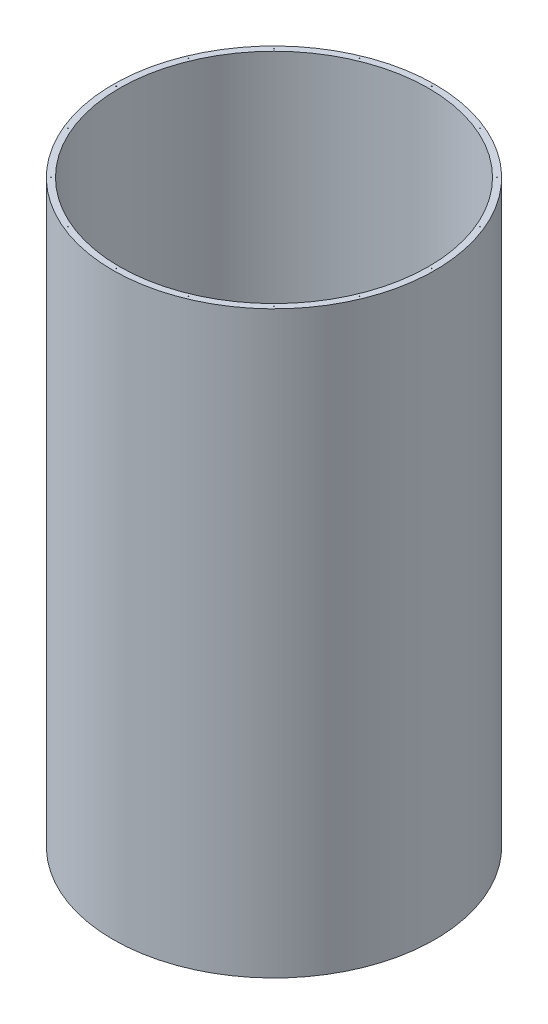
ISO-10303-21;
HEADER;
FILE_DESCRIPTION(('STEP AP214'),'2;1');
FILE_NAME('part.step','',(''),(''),'','','');
FILE_SCHEMA(('AUTOMOTIVE_DESIGN { 1 0 10303 214 1 1 1 1 }'));
ENDSEC;
DATA;
#1=APPLICATION_CONTEXT('core data for automotive mechanical design processes');
#2=APPLICATION_PROTOCOL_DEFINITION('international standard','automotive_design',2000,#1);
#3=PRODUCT_CONTEXT('',#1,'mechanical');
#4=PRODUCT('Part','Part','',(#3));
#5=PRODUCT_RELATED_PRODUCT_CATEGORY('part','',(#4));
#6=PRODUCT_DEFINITION_FORMATION('','',#4);
#7=PRODUCT_DEFINITION_CONTEXT('part definition',#1,'design');
#8=PRODUCT_DEFINITION('design','',#6,#7);
#9=PRODUCT_DEFINITION_SHAPE('','',#8);
#10=(LENGTH_UNIT() NAMED_UNIT(*) SI_UNIT(.MILLI.,.METRE.));
#11=(NAMED_UNIT(*) PLANE_ANGLE_UNIT() SI_UNIT($,.RADIAN.));
#12=(NAMED_UNIT(*) SI_UNIT($,.STERADIAN.) SOLID_ANGLE_UNIT());
#13=UNCERTAINTY_MEASURE_WITH_UNIT(LENGTH_MEASURE(1.E-05),#10,'distance_accuracy_value','');
#14=(GEOMETRIC_REPRESENTATION_CONTEXT(3) GLOBAL_UNCERTAINTY_ASSIGNED_CONTEXT((#13)) GLOBAL_UNIT_ASSIGNED_CONTEXT((#10,
#11,#12)) REPRESENTATION_CONTEXT('',''));
#15=CARTESIAN_POINT('',(0.,0.,0.));
#16=DIRECTION('',(0.,0.,1.));
#17=DIRECTION('',(1.,0.,0.));
#18=AXIS2_PLACEMENT_3D('',#15,#16,#17);
#19=CARTESIAN_POINT('',(0.,4500.,0.));
#20=DIRECTION('',(0.,1.,0.));
#21=DIRECTION('',(0.,0.,1.));
#22=AXIS2_PLACEMENT_3D('',#19,#20,#21);
#23=PLANE('',#22);
#24=CARTESIAN_POINT('',(-1225.,4500.,0.));
#25=DIRECTION('',(0.,1.,0.));
#26=DIRECTION('',(0.,0.,1.));
#27=AXIS2_PLACEMENT_3D('',#24,#25,#26);
#28=CIRCLE('',#27,3.17499999999986);
#29=CARTESIAN_POINT('',(-1225.,4500.,3.17499999999986));
#30=VERTEX_POINT('',#29);
#31=EDGE_CURVE('E144',#30,#30,#28,.T.);
#32=ORIENTED_EDGE('',*,*,#31,.F.);
#33=EDGE_LOOP('',(#32));
#34=FACE_BOUND('',#33,.T.);
#35=CARTESIAN_POINT('',(-1131.75242732633,4500.,-468.787204647236));
#36=DIRECTION('',(0.,1.,0.));
#37=DIRECTION('',(0.,0.,1.));
#38=AXIS2_PLACEMENT_3D('',#35,#36,#37);
#39=CIRCLE('',#38,3.17499999999989);
#40=CARTESIAN_POINT('',(-1131.75242732633,4500.,-465.612204647236));
#41=VERTEX_POINT('',#40);
#42=EDGE_CURVE('E141',#41,#41,#39,.T.);
#43=ORIENTED_EDGE('',*,*,#42,.F.);
#44=EDGE_LOOP('',(#43));
#45=FACE_BOUND('',#44,.T.);
#46=CARTESIAN_POINT('',(-866.205806953519,4500.,-866.205806953522));
#47=DIRECTION('',(0.,1.,0.));
#48=DIRECTION('',(0.,0.,1.));
#49=AXIS2_PLACEMENT_3D('',#46,#47,#48);
#50=CIRCLE('',#49,3.17499999999983);
#51=CARTESIAN_POINT('',(-866.205806953519,4500.,-863.030806953523));
#52=VERTEX_POINT('',#51);
#53=EDGE_CURVE('E135',#52,#52,#50,.T.);
#54=ORIENTED_EDGE('',*,*,#53,.F.);
#55=EDGE_LOOP('',(#54));
#56=FACE_BOUND('',#55,.T.);
#57=CARTESIAN_POINT('',(-468.787204647232,4500.,-1131.75242732633));
#58=DIRECTION('',(0.,1.,0.));
#59=DIRECTION('',(0.,0.,1.));
#60=AXIS2_PLACEMENT_3D('',#57,#58,#59);
#61=CIRCLE('',#60,3.17499999999994);
#62=CARTESIAN_POINT('',(-468.787204647232,4500.,-1128.57742732633));
#63=VERTEX_POINT('',#62);
#64=EDGE_CURVE('E129',#63,#63,#61,.T.);
#65=ORIENTED_EDGE('',*,*,#64,.F.);
#66=EDGE_LOOP('',(#65));
#67=FACE_BOUND('',#66,.T.);
#68=CARTESIAN_POINT('',(4.27706464008284E-12,4500.,-1225.));
#69=DIRECTION('',(0.,1.,0.));
#70=DIRECTION('',(0.,0.,1.));
#71=AXIS2_PLACEMENT_3D('',#68,#69,#70);
#72=CIRCLE('',#71,3.17499999999986);
#73=CARTESIAN_POINT('',(4.27706464008284E-12,4500.,-1221.825));
#74=VERTEX_POINT('',#73);
#75=EDGE_CURVE('E123',#74,#74,#72,.T.);
#76=ORIENTED_EDGE('',*,*,#75,.F.);
#77=EDGE_LOOP('',(#76));
#78=FACE_BOUND('',#77,.T.);
#79=CARTESIAN_POINT('',(468.78720464724,4500.,-1131.75242732632));
#80=DIRECTION('',(0.,1.,0.));
#81=DIRECTION('',(0.,0.,1.));
#82=AXIS2_PLACEMENT_3D('',#79,#80,#81);
#83=CIRCLE('',#82,3.17499999999989);
#84=CARTESIAN_POINT('',(468.78720464724,4500.,-1128.57742732632));
#85=VERTEX_POINT('',#84);
#86=EDGE_CURVE('E117',#85,#85,#83,.T.);
#87=ORIENTED_EDGE('',*,*,#86,.F.);
#88=EDGE_LOOP('',(#87));
#89=FACE_BOUND('',#88,.T.);
#90=CARTESIAN_POINT('',(866.205806953525,4500.,-866.205806953517));
#91=DIRECTION('',(0.,1.,0.));
#92=DIRECTION('',(0.,0.,1.));
#93=AXIS2_PLACEMENT_3D('',#90,#91,#92);
#94=CIRCLE('',#93,3.17499999999983);
#95=CARTESIAN_POINT('',(866.205806953525,4500.,-863.030806953517));
#96=VERTEX_POINT('',#95);
#97=EDGE_CURVE('E111',#96,#96,#94,.T.);
#98=ORIENTED_EDGE('',*,*,#97,.F.);
#99=EDGE_LOOP('',(#98));
#100=FACE_BOUND('',#99,.T.);
#101=CARTESIAN_POINT('',(1131.75242732633,4500.,-468.787204647228));
#102=DIRECTION('',(0.,1.,0.));
#103=DIRECTION('',(0.,0.,1.));
#104=AXIS2_PLACEMENT_3D('',#101,#102,#103);
#105=CIRCLE('',#104,3.1749999999999);
#106=CARTESIAN_POINT('',(1131.75242732633,4500.,-465.612204647228));
#107=VERTEX_POINT('',#106);
#108=EDGE_CURVE('E105',#107,#107,#105,.T.);
#109=ORIENTED_EDGE('',*,*,#108,.F.);
#110=EDGE_LOOP('',(#109));
#111=FACE_BOUND('',#110,.T.);
#112=CARTESIAN_POINT('',(1225.,4500.,8.55412928016568E-12));
#113=DIRECTION('',(0.,1.,0.));
#114=DIRECTION('',(0.,0.,1.));
#115=AXIS2_PLACEMENT_3D('',#112,#113,#114);
#116=CIRCLE('',#115,3.17499999999985);
#117=CARTESIAN_POINT('',(1225.,4500.,3.17500000000841));
#118=VERTEX_POINT('',#117);
#119=EDGE_CURVE('E99',#118,#118,#116,.T.);
#120=ORIENTED_EDGE('',*,*,#119,.F.);
#121=EDGE_LOOP('',(#120));
#122=FACE_BOUND('',#121,.T.);
#123=CARTESIAN_POINT('',(1131.75242732632,4500.,468.787204647244));
#124=DIRECTION('',(0.,1.,0.));
#125=DIRECTION('',(0.,0.,1.));
#126=AXIS2_PLACEMENT_3D('',#123,#124,#125);
#127=CIRCLE('',#126,3.17499999999989);
#128=CARTESIAN_POINT('',(1131.75242732632,4500.,471.962204647244));
#129=VERTEX_POINT('',#128);
#130=EDGE_CURVE('E93',#129,#129,#127,.T.);
#131=ORIENTED_EDGE('',*,*,#130,.F.);
#132=EDGE_LOOP('',(#131));
#133=FACE_BOUND('',#132,.T.);
#134=CARTESIAN_POINT('',(866.205806953513,4500.,866.205806953528));
#135=DIRECTION('',(0.,1.,0.));
#136=DIRECTION('',(0.,0.,1.));
#137=AXIS2_PLACEMENT_3D('',#134,#135,#136);
#138=CIRCLE('',#137,3.17499999999983);
#139=CARTESIAN_POINT('',(866.205806953513,4500.,869.380806953528));
#140=VERTEX_POINT('',#139);
#141=EDGE_CURVE('E87',#140,#140,#138,.T.);
#142=ORIENTED_EDGE('',*,*,#141,.F.);
#143=EDGE_LOOP('',(#142));
#144=FACE_BOUND('',#143,.T.);
#145=CARTESIAN_POINT('',(468.787204647224,4500.,1131.75242732633));
#146=DIRECTION('',(0.,1.,0.));
#147=DIRECTION('',(0.,0.,1.));
#148=AXIS2_PLACEMENT_3D('',#145,#146,#147);
#149=CIRCLE('',#148,3.17499999999994);
#150=CARTESIAN_POINT('',(468.787204647224,4500.,1134.92742732633));
#151=VERTEX_POINT('',#150);
#152=EDGE_CURVE('E81',#151,#151,#149,.T.);
#153=ORIENTED_EDGE('',*,*,#152,.F.);
#154=EDGE_LOOP('',(#153));
#155=FACE_BOUND('',#154,.T.);
#156=CARTESIAN_POINT('',(-1.28311939202485E-11,4500.,1225.));
#157=DIRECTION('',(0.,1.,0.));
#158=DIRECTION('',(0.,0.,1.));
#159=AXIS2_PLACEMENT_3D('',#156,#157,#158);
#160=CIRCLE('',#159,3.17499999999985);
#161=CARTESIAN_POINT('',(-1.28311939202485E-11,4500.,1228.175));
#162=VERTEX_POINT('',#161);
#163=EDGE_CURVE('E75',#162,#162,#160,.T.);
#164=ORIENTED_EDGE('',*,*,#163,.F.);
#165=EDGE_LOOP('',(#164));
#166=FACE_BOUND('',#165,.T.);
#167=CARTESIAN_POINT('',(-468.787204647247,4500.,1131.75242732632));
#168=DIRECTION('',(0.,1.,0.));
#169=DIRECTION('',(0.,0.,1.));
#170=AXIS2_PLACEMENT_3D('',#167,#168,#169);
#171=CIRCLE('',#170,3.17499999999989);
#172=CARTESIAN_POINT('',(-468.787204647247,4500.,1134.92742732632));
#173=VERTEX_POINT('',#172);
#174=EDGE_CURVE('E69',#173,#173,#171,.T.);
#175=ORIENTED_EDGE('',*,*,#174,.F.);
#176=EDGE_LOOP('',(#175));
#177=FACE_BOUND('',#176,.T.);
#178=CARTESIAN_POINT('',(-866.205806953531,4500.,866.20580695351));
#179=DIRECTION('',(0.,1.,0.));
#180=DIRECTION('',(0.,0.,1.));
#181=AXIS2_PLACEMENT_3D('',#178,#179,#180);
#182=CIRCLE('',#181,3.17499999999988);
#183=CARTESIAN_POINT('',(-866.205806953531,4500.,869.38080695351));
#184=VERTEX_POINT('',#183);
#185=EDGE_CURVE('E63',#184,#184,#182,.T.);
#186=ORIENTED_EDGE('',*,*,#185,.F.);
#187=EDGE_LOOP('',(#186));
#188=FACE_BOUND('',#187,.T.);
#189=CARTESIAN_POINT('',(-1131.75242732633,4500.,468.78720464722));
#190=DIRECTION('',(0.,1.,0.));
#191=DIRECTION('',(0.,0.,1.));
#192=AXIS2_PLACEMENT_3D('',#189,#190,#191);
#193=CIRCLE('',#192,3.17499999999976);
#194=CARTESIAN_POINT('',(-1131.75242732633,4500.,471.962204647219));
#195=VERTEX_POINT('',#194);
#196=EDGE_CURVE('E57',#195,#195,#193,.T.);
#197=ORIENTED_EDGE('',*,*,#196,.F.);
#198=EDGE_LOOP('',(#197));
#199=FACE_BOUND('',#198,.T.);
#200=CARTESIAN_POINT('',(0.,4500.,0.));
#201=DIRECTION('',(0.,1.,0.));
#202=DIRECTION('',(0.,0.,1.));
#203=AXIS2_PLACEMENT_3D('',#200,#201,#202);
#204=CIRCLE('',#203,1250.);
#205=CARTESIAN_POINT('',(0.,4500.,1250.));
#206=VERTEX_POINT('',#205);
#207=EDGE_CURVE('E10',#206,#206,#204,.T.);
#208=ORIENTED_EDGE('',*,*,#207,.T.);
#209=EDGE_LOOP('',(#208));
#210=FACE_BOUND('',#209,.T.);
#211=CARTESIAN_POINT('',(0.,4500.,0.));
#212=DIRECTION('',(0.,1.,0.));
#213=DIRECTION('',(0.,0.,1.));
#214=AXIS2_PLACEMENT_3D('',#211,#212,#213);
#215=CIRCLE('',#214,1200.000000046);
#216=CARTESIAN_POINT('',(0.,4500.,1200.000000046));
#217=VERTEX_POINT('',#216);
#218=EDGE_CURVE('E46',#217,#217,#215,.T.);
#219=ORIENTED_EDGE('',*,*,#218,.F.);
#220=EDGE_LOOP('',(#219));
#221=FACE_BOUND('',#220,.T.);
#222=ADVANCED_FACE('F35',(#34,#45,#56,#67,#78,#89,#100,#111,#122,#133,#144,#155,#166,#177,#188,
#199,#210,#221),#23,.T.);
#223=CARTESIAN_POINT('',(0.,0.,0.));
#224=DIRECTION('',(0.,1.,0.));
#225=DIRECTION('',(0.,0.,1.));
#226=AXIS2_PLACEMENT_3D('',#223,#224,#225);
#227=PLANE('',#226);
#228=CARTESIAN_POINT('',(0.,0.,0.));
#229=DIRECTION('',(0.,1.,0.));
#230=DIRECTION('',(0.,0.,1.));
#231=AXIS2_PLACEMENT_3D('',#228,#229,#230);
#232=CIRCLE('',#231,1250.);
#233=CARTESIAN_POINT('',(0.,0.,1250.));
#234=VERTEX_POINT('',#233);
#235=EDGE_CURVE('E39',#234,#234,#232,.T.);
#236=ORIENTED_EDGE('',*,*,#235,.F.);
#237=EDGE_LOOP('',(#236));
#238=FACE_BOUND('',#237,.T.);
#239=CARTESIAN_POINT('',(0.,0.,0.));
#240=DIRECTION('',(0.,1.,0.));
#241=DIRECTION('',(0.,0.,1.));
#242=AXIS2_PLACEMENT_3D('',#239,#240,#241);
#243=CIRCLE('',#242,1200.000000046);
#244=CARTESIAN_POINT('',(0.,0.,1200.000000046));
#245=VERTEX_POINT('',#244);
#246=EDGE_CURVE('E48',#245,#245,#243,.T.);
#247=ORIENTED_EDGE('',*,*,#246,.T.);
#248=EDGE_LOOP('',(#247));
#249=FACE_BOUND('',#248,.T.);
#250=ADVANCED_FACE('F161',(#238,#249),#227,.F.);
#251=CARTESIAN_POINT('',(0.,4500.,0.));
#252=DIRECTION('',(0.,-1.,0.));
#253=DIRECTION('',(0.,0.,-1.));
#254=AXIS2_PLACEMENT_3D('',#251,#252,#253);
#255=CYLINDRICAL_SURFACE('',#254,1250.);
#256=ORIENTED_EDGE('',*,*,#207,.F.);
#257=EDGE_LOOP('',(#256));
#258=FACE_BOUND('',#257,.T.);
#259=ORIENTED_EDGE('',*,*,#235,.T.);
#260=EDGE_LOOP('',(#259));
#261=FACE_BOUND('',#260,.T.);
#262=ADVANCED_FACE('F37',(#258,#261),#255,.T.);
#263=CARTESIAN_POINT('',(0.,4500.,0.));
#264=DIRECTION('',(0.,-1.,0.));
#265=DIRECTION('',(0.,0.,-1.));
#266=AXIS2_PLACEMENT_3D('',#263,#264,#265);
#267=CYLINDRICAL_SURFACE('',#266,1200.000000046);
#268=ORIENTED_EDGE('',*,*,#218,.T.);
#269=EDGE_LOOP('',(#268));
#270=FACE_BOUND('',#269,.T.);
#271=ORIENTED_EDGE('',*,*,#246,.F.);
#272=EDGE_LOOP('',(#271));
#273=FACE_BOUND('',#272,.T.);
#274=ADVANCED_FACE('F195',(#270,#273),#267,.F.);
#275=CARTESIAN_POINT('',(-1131.75242732633,4487.3,468.78720464722));
#276=DIRECTION('',(0.,1.,0.));
#277=DIRECTION('',(0.,0.,1.));
#278=AXIS2_PLACEMENT_3D('',#275,#276,#277);
#279=CYLINDRICAL_SURFACE('',#278,3.17499999999976);
#280=CARTESIAN_POINT('',(-1131.75242732633,4487.3,468.78720464722));
#281=DIRECTION('',(0.,1.,0.));
#282=DIRECTION('',(0.,0.,1.));
#283=AXIS2_PLACEMENT_3D('',#280,#281,#282);
#284=CIRCLE('',#283,3.17499999999976);
#285=CARTESIAN_POINT('',(-1131.75242732633,4487.3,471.962204647219));
#286=VERTEX_POINT('',#285);
#287=EDGE_CURVE('E54',#286,#286,#284,.T.);
#288=ORIENTED_EDGE('',*,*,#287,.F.);
#289=EDGE_LOOP('',(#288));
#290=FACE_BOUND('',#289,.T.);
#291=ORIENTED_EDGE('',*,*,#196,.T.);
#292=EDGE_LOOP('',(#291));
#293=FACE_BOUND('',#292,.T.);
#294=ADVANCED_FACE('F198',(#290,#293),#279,.F.);
#295=CARTESIAN_POINT('',(-1131.75242732633,4487.3,468.78720464722));
#296=DIRECTION('',(0.,1.,0.));
#297=DIRECTION('',(0.,0.,1.));
#298=AXIS2_PLACEMENT_3D('',#295,#296,#297);
#299=PLANE('',#298);
#300=ORIENTED_EDGE('',*,*,#287,.T.);
#301=EDGE_LOOP('',(#300));
#302=FACE_BOUND('',#301,.T.);
#303=ADVANCED_FACE('F210',(#302),#299,.T.);
#304=CARTESIAN_POINT('',(-866.205806953531,4487.3,866.20580695351));
#305=DIRECTION('',(0.,1.,0.));
#306=DIRECTION('',(0.,0.,1.));
#307=AXIS2_PLACEMENT_3D('',#304,#305,#306);
#308=CYLINDRICAL_SURFACE('',#307,3.17499999999988);
#309=CARTESIAN_POINT('',(-866.205806953531,4487.3,866.20580695351));
#310=DIRECTION('',(0.,1.,0.));
#311=DIRECTION('',(0.,0.,1.));
#312=AXIS2_PLACEMENT_3D('',#309,#310,#311);
#313=CIRCLE('',#312,3.17499999999988);
#314=CARTESIAN_POINT('',(-866.205806953531,4487.3,869.38080695351));
#315=VERTEX_POINT('',#314);
#316=EDGE_CURVE('E60',#315,#315,#313,.T.);
#317=ORIENTED_EDGE('',*,*,#316,.F.);
#318=EDGE_LOOP('',(#317));
#319=FACE_BOUND('',#318,.T.);
#320=ORIENTED_EDGE('',*,*,#185,.T.);
#321=EDGE_LOOP('',(#320));
#322=FACE_BOUND('',#321,.T.);
#323=ADVANCED_FACE('F213',(#319,#322),#308,.F.);
#324=CARTESIAN_POINT('',(-866.205806953531,4487.3,866.20580695351));
#325=DIRECTION('',(0.,1.,0.));
#326=DIRECTION('',(0.,0.,1.));
#327=AXIS2_PLACEMENT_3D('',#324,#325,#326);
#328=PLANE('',#327);
#329=ORIENTED_EDGE('',*,*,#316,.T.);
#330=EDGE_LOOP('',(#329));
#331=FACE_BOUND('',#330,.T.);
#332=ADVANCED_FACE('F218',(#331),#328,.T.);
#333=CARTESIAN_POINT('',(-468.787204647247,4487.3,1131.75242732632));
#334=DIRECTION('',(0.,1.,0.));
#335=DIRECTION('',(0.,0.,1.));
#336=AXIS2_PLACEMENT_3D('',#333,#334,#335);
#337=CYLINDRICAL_SURFACE('',#336,3.17499999999989);
#338=CARTESIAN_POINT('',(-468.787204647247,4487.3,1131.75242732632));
#339=DIRECTION('',(0.,1.,0.));
#340=DIRECTION('',(0.,0.,1.));
#341=AXIS2_PLACEMENT_3D('',#338,#339,#340);
#342=CIRCLE('',#341,3.17499999999989);
#343=CARTESIAN_POINT('',(-468.787204647247,4487.3,1134.92742732632));
#344=VERTEX_POINT('',#343);
#345=EDGE_CURVE('E66',#344,#344,#342,.T.);
#346=ORIENTED_EDGE('',*,*,#345,.F.);
#347=EDGE_LOOP('',(#346));
#348=FACE_BOUND('',#347,.T.);
#349=ORIENTED_EDGE('',*,*,#174,.T.);
#350=EDGE_LOOP('',(#349));
#351=FACE_BOUND('',#350,.T.);
#352=ADVANCED_FACE('F221',(#348,#351),#337,.F.);
#353=CARTESIAN_POINT('',(-468.787204647247,4487.3,1131.75242732632));
#354=DIRECTION('',(0.,1.,0.));
#355=DIRECTION('',(0.,0.,1.));
#356=AXIS2_PLACEMENT_3D('',#353,#354,#355);
#357=PLANE('',#356);
#358=ORIENTED_EDGE('',*,*,#345,.T.);
#359=EDGE_LOOP('',(#358));
#360=FACE_BOUND('',#359,.T.);
#361=ADVANCED_FACE('F226',(#360),#357,.T.);
#362=CARTESIAN_POINT('',(-1.28311939202485E-11,4487.3,1225.));
#363=DIRECTION('',(0.,1.,0.));
#364=DIRECTION('',(0.,0.,1.));
#365=AXIS2_PLACEMENT_3D('',#362,#363,#364);
#366=CYLINDRICAL_SURFACE('',#365,3.17499999999985);
#367=CARTESIAN_POINT('',(-1.28311939202485E-11,4487.3,1225.));
#368=DIRECTION('',(0.,1.,0.));
#369=DIRECTION('',(0.,0.,1.));
#370=AXIS2_PLACEMENT_3D('',#367,#368,#369);
#371=CIRCLE('',#370,3.17499999999985);
#372=CARTESIAN_POINT('',(-1.28311939202485E-11,4487.3,1228.175));
#373=VERTEX_POINT('',#372);
#374=EDGE_CURVE('E72',#373,#373,#371,.T.);
#375=ORIENTED_EDGE('',*,*,#374,.F.);
#376=EDGE_LOOP('',(#375));
#377=FACE_BOUND('',#376,.T.);
#378=ORIENTED_EDGE('',*,*,#163,.T.);
#379=EDGE_LOOP('',(#378));
#380=FACE_BOUND('',#379,.T.);
#381=ADVANCED_FACE('F229',(#377,#380),#366,.F.);
#382=CARTESIAN_POINT('',(-1.28311939202485E-11,4487.3,1225.));
#383=DIRECTION('',(0.,1.,0.));
#384=DIRECTION('',(0.,0.,1.));
#385=AXIS2_PLACEMENT_3D('',#382,#383,#384);
#386=PLANE('',#385);
#387=ORIENTED_EDGE('',*,*,#374,.T.);
#388=EDGE_LOOP('',(#387));
#389=FACE_BOUND('',#388,.T.);
#390=ADVANCED_FACE('F234',(#389),#386,.T.);
#391=CARTESIAN_POINT('',(468.787204647224,4487.3,1131.75242732633));
#392=DIRECTION('',(0.,1.,0.));
#393=DIRECTION('',(0.,0.,1.));
#394=AXIS2_PLACEMENT_3D('',#391,#392,#393);
#395=CYLINDRICAL_SURFACE('',#394,3.17499999999994);
#396=CARTESIAN_POINT('',(468.787204647224,4487.3,1131.75242732633));
#397=DIRECTION('',(0.,1.,0.));
#398=DIRECTION('',(0.,0.,1.));
#399=AXIS2_PLACEMENT_3D('',#396,#397,#398);
#400=CIRCLE('',#399,3.17499999999994);
#401=CARTESIAN_POINT('',(468.787204647224,4487.3,1134.92742732633));
#402=VERTEX_POINT('',#401);
#403=EDGE_CURVE('E78',#402,#402,#400,.T.);
#404=ORIENTED_EDGE('',*,*,#403,.F.);
#405=EDGE_LOOP('',(#404));
#406=FACE_BOUND('',#405,.T.);
#407=ORIENTED_EDGE('',*,*,#152,.T.);
#408=EDGE_LOOP('',(#407));
#409=FACE_BOUND('',#408,.T.);
#410=ADVANCED_FACE('F237',(#406,#409),#395,.F.);
#411=CARTESIAN_POINT('',(468.787204647224,4487.3,1131.75242732633));
#412=DIRECTION('',(0.,1.,0.));
#413=DIRECTION('',(0.,0.,1.));
#414=AXIS2_PLACEMENT_3D('',#411,#412,#413);
#415=PLANE('',#414);
#416=ORIENTED_EDGE('',*,*,#403,.T.);
#417=EDGE_LOOP('',(#416));
#418=FACE_BOUND('',#417,.T.);
#419=ADVANCED_FACE('F242',(#418),#415,.T.);
#420=CARTESIAN_POINT('',(866.205806953513,4487.3,866.205806953528));
#421=DIRECTION('',(0.,1.,0.));
#422=DIRECTION('',(0.,0.,1.));
#423=AXIS2_PLACEMENT_3D('',#420,#421,#422);
#424=CYLINDRICAL_SURFACE('',#423,3.17499999999983);
#425=CARTESIAN_POINT('',(866.205806953513,4487.3,866.205806953528));
#426=DIRECTION('',(0.,1.,0.));
#427=DIRECTION('',(0.,0.,1.));
#428=AXIS2_PLACEMENT_3D('',#425,#426,#427);
#429=CIRCLE('',#428,3.17499999999983);
#430=CARTESIAN_POINT('',(866.205806953513,4487.3,869.380806953528));
#431=VERTEX_POINT('',#430);
#432=EDGE_CURVE('E84',#431,#431,#429,.T.);
#433=ORIENTED_EDGE('',*,*,#432,.F.);
#434=EDGE_LOOP('',(#433));
#435=FACE_BOUND('',#434,.T.);
#436=ORIENTED_EDGE('',*,*,#141,.T.);
#437=EDGE_LOOP('',(#436));
#438=FACE_BOUND('',#437,.T.);
#439=ADVANCED_FACE('F245',(#435,#438),#424,.F.);
#440=CARTESIAN_POINT('',(866.205806953513,4487.3,866.205806953528));
#441=DIRECTION('',(0.,1.,0.));
#442=DIRECTION('',(0.,0.,1.));
#443=AXIS2_PLACEMENT_3D('',#440,#441,#442);
#444=PLANE('',#443);
#445=ORIENTED_EDGE('',*,*,#432,.T.);
#446=EDGE_LOOP('',(#445));
#447=FACE_BOUND('',#446,.T.);
#448=ADVANCED_FACE('F250',(#447),#444,.T.);
#449=CARTESIAN_POINT('',(1131.75242732632,4487.3,468.787204647244));
#450=DIRECTION('',(0.,1.,0.));
#451=DIRECTION('',(0.,0.,1.));
#452=AXIS2_PLACEMENT_3D('',#449,#450,#451);
#453=CYLINDRICAL_SURFACE('',#452,3.17499999999989);
#454=CARTESIAN_POINT('',(1131.75242732632,4487.3,468.787204647244));
#455=DIRECTION('',(0.,1.,0.));
#456=DIRECTION('',(0.,0.,1.));
#457=AXIS2_PLACEMENT_3D('',#454,#455,#456);
#458=CIRCLE('',#457,3.17499999999989);
#459=CARTESIAN_POINT('',(1131.75242732632,4487.3,471.962204647244));
#460=VERTEX_POINT('',#459);
#461=EDGE_CURVE('E90',#460,#460,#458,.T.);
#462=ORIENTED_EDGE('',*,*,#461,.F.);
#463=EDGE_LOOP('',(#462));
#464=FACE_BOUND('',#463,.T.);
#465=ORIENTED_EDGE('',*,*,#130,.T.);
#466=EDGE_LOOP('',(#465));
#467=FACE_BOUND('',#466,.T.);
#468=ADVANCED_FACE('F253',(#464,#467),#453,.F.);
#469=CARTESIAN_POINT('',(1131.75242732632,4487.3,468.787204647244));
#470=DIRECTION('',(0.,1.,0.));
#471=DIRECTION('',(0.,0.,1.));
#472=AXIS2_PLACEMENT_3D('',#469,#470,#471);
#473=PLANE('',#472);
#474=ORIENTED_EDGE('',*,*,#461,.T.);
#475=EDGE_LOOP('',(#474));
#476=FACE_BOUND('',#475,.T.);
#477=ADVANCED_FACE('F258',(#476),#473,.T.);
#478=CARTESIAN_POINT('',(1225.,4487.3,8.55412928016568E-12));
#479=DIRECTION('',(0.,1.,0.));
#480=DIRECTION('',(0.,0.,1.));
#481=AXIS2_PLACEMENT_3D('',#478,#479,#480);
#482=CYLINDRICAL_SURFACE('',#481,3.17499999999985);
#483=CARTESIAN_POINT('',(1225.,4487.3,8.55412928016568E-12));
#484=DIRECTION('',(0.,1.,0.));
#485=DIRECTION('',(0.,0.,1.));
#486=AXIS2_PLACEMENT_3D('',#483,#484,#485);
#487=CIRCLE('',#486,3.17499999999985);
#488=CARTESIAN_POINT('',(1225.,4487.3,3.17500000000841));
#489=VERTEX_POINT('',#488);
#490=EDGE_CURVE('E96',#489,#489,#487,.T.);
#491=ORIENTED_EDGE('',*,*,#490,.F.);
#492=EDGE_LOOP('',(#491));
#493=FACE_BOUND('',#492,.T.);
#494=ORIENTED_EDGE('',*,*,#119,.T.);
#495=EDGE_LOOP('',(#494));
#496=FACE_BOUND('',#495,.T.);
#497=ADVANCED_FACE('F261',(#493,#496),#482,.F.);
#498=CARTESIAN_POINT('',(1225.,4487.3,8.55412928016568E-12));
#499=DIRECTION('',(0.,1.,0.));
#500=DIRECTION('',(0.,0.,1.));
#501=AXIS2_PLACEMENT_3D('',#498,#499,#500);
#502=PLANE('',#501);
#503=ORIENTED_EDGE('',*,*,#490,.T.);
#504=EDGE_LOOP('',(#503));
#505=FACE_BOUND('',#504,.T.);
#506=ADVANCED_FACE('F266',(#505),#502,.T.);
#507=CARTESIAN_POINT('',(1131.75242732633,4487.3,-468.787204647228));
#508=DIRECTION('',(0.,1.,0.));
#509=DIRECTION('',(0.,0.,1.));
#510=AXIS2_PLACEMENT_3D('',#507,#508,#509);
#511=CYLINDRICAL_SURFACE('',#510,3.1749999999999);
#512=CARTESIAN_POINT('',(1131.75242732633,4487.3,-468.787204647228));
#513=DIRECTION('',(0.,1.,0.));
#514=DIRECTION('',(0.,0.,1.));
#515=AXIS2_PLACEMENT_3D('',#512,#513,#514);
#516=CIRCLE('',#515,3.1749999999999);
#517=CARTESIAN_POINT('',(1131.75242732633,4487.3,-465.612204647228));
#518=VERTEX_POINT('',#517);
#519=EDGE_CURVE('E102',#518,#518,#516,.T.);
#520=ORIENTED_EDGE('',*,*,#519,.F.);
#521=EDGE_LOOP('',(#520));
#522=FACE_BOUND('',#521,.T.);
#523=ORIENTED_EDGE('',*,*,#108,.T.);
#524=EDGE_LOOP('',(#523));
#525=FACE_BOUND('',#524,.T.);
#526=ADVANCED_FACE('F269',(#522,#525),#511,.F.);
#527=CARTESIAN_POINT('',(1131.75242732633,4487.3,-468.787204647228));
#528=DIRECTION('',(0.,1.,0.));
#529=DIRECTION('',(0.,0.,1.));
#530=AXIS2_PLACEMENT_3D('',#527,#528,#529);
#531=PLANE('',#530);
#532=ORIENTED_EDGE('',*,*,#519,.T.);
#533=EDGE_LOOP('',(#532));
#534=FACE_BOUND('',#533,.T.);
#535=ADVANCED_FACE('F274',(#534),#531,.T.);
#536=CARTESIAN_POINT('',(866.205806953525,4487.3,-866.205806953517));
#537=DIRECTION('',(0.,1.,0.));
#538=DIRECTION('',(0.,0.,1.));
#539=AXIS2_PLACEMENT_3D('',#536,#537,#538);
#540=CYLINDRICAL_SURFACE('',#539,3.17499999999983);
#541=CARTESIAN_POINT('',(866.205806953525,4487.3,-866.205806953517));
#542=DIRECTION('',(0.,1.,0.));
#543=DIRECTION('',(0.,0.,1.));
#544=AXIS2_PLACEMENT_3D('',#541,#542,#543);
#545=CIRCLE('',#544,3.17499999999983);
#546=CARTESIAN_POINT('',(866.205806953525,4487.3,-863.030806953517));
#547=VERTEX_POINT('',#546);
#548=EDGE_CURVE('E108',#547,#547,#545,.T.);
#549=ORIENTED_EDGE('',*,*,#548,.F.);
#550=EDGE_LOOP('',(#549));
#551=FACE_BOUND('',#550,.T.);
#552=ORIENTED_EDGE('',*,*,#97,.T.);
#553=EDGE_LOOP('',(#552));
#554=FACE_BOUND('',#553,.T.);
#555=ADVANCED_FACE('F277',(#551,#554),#540,.F.);
#556=CARTESIAN_POINT('',(866.205806953525,4487.3,-866.205806953517));
#557=DIRECTION('',(0.,1.,0.));
#558=DIRECTION('',(0.,0.,1.));
#559=AXIS2_PLACEMENT_3D('',#556,#557,#558);
#560=PLANE('',#559);
#561=ORIENTED_EDGE('',*,*,#548,.T.);
#562=EDGE_LOOP('',(#561));
#563=FACE_BOUND('',#562,.T.);
#564=ADVANCED_FACE('F282',(#563),#560,.T.);
#565=CARTESIAN_POINT('',(468.78720464724,4487.3,-1131.75242732632));
#566=DIRECTION('',(0.,1.,0.));
#567=DIRECTION('',(0.,0.,1.));
#568=AXIS2_PLACEMENT_3D('',#565,#566,#567);
#569=CYLINDRICAL_SURFACE('',#568,3.17499999999989);
#570=CARTESIAN_POINT('',(468.78720464724,4487.3,-1131.75242732632));
#571=DIRECTION('',(0.,1.,0.));
#572=DIRECTION('',(0.,0.,1.));
#573=AXIS2_PLACEMENT_3D('',#570,#571,#572);
#574=CIRCLE('',#573,3.17499999999989);
#575=CARTESIAN_POINT('',(468.78720464724,4487.3,-1128.57742732632));
#576=VERTEX_POINT('',#575);
#577=EDGE_CURVE('E114',#576,#576,#574,.T.);
#578=ORIENTED_EDGE('',*,*,#577,.F.);
#579=EDGE_LOOP('',(#578));
#580=FACE_BOUND('',#579,.T.);
#581=ORIENTED_EDGE('',*,*,#86,.T.);
#582=EDGE_LOOP('',(#581));
#583=FACE_BOUND('',#582,.T.);
#584=ADVANCED_FACE('F285',(#580,#583),#569,.F.);
#585=CARTESIAN_POINT('',(468.78720464724,4487.3,-1131.75242732632));
#586=DIRECTION('',(0.,1.,0.));
#587=DIRECTION('',(0.,0.,1.));
#588=AXIS2_PLACEMENT_3D('',#585,#586,#587);
#589=PLANE('',#588);
#590=ORIENTED_EDGE('',*,*,#577,.T.);
#591=EDGE_LOOP('',(#590));
#592=FACE_BOUND('',#591,.T.);
#593=ADVANCED_FACE('F290',(#592),#589,.T.);
#594=CARTESIAN_POINT('',(4.27706464008284E-12,4487.3,-1225.));
#595=DIRECTION('',(0.,1.,0.));
#596=DIRECTION('',(0.,0.,1.));
#597=AXIS2_PLACEMENT_3D('',#594,#595,#596);
#598=CYLINDRICAL_SURFACE('',#597,3.17499999999986);
#599=CARTESIAN_POINT('',(4.27706464008284E-12,4487.3,-1225.));
#600=DIRECTION('',(0.,1.,0.));
#601=DIRECTION('',(0.,0.,1.));
#602=AXIS2_PLACEMENT_3D('',#599,#600,#601);
#603=CIRCLE('',#602,3.17499999999986);
#604=CARTESIAN_POINT('',(4.27706464008284E-12,4487.3,-1221.825));
#605=VERTEX_POINT('',#604);
#606=EDGE_CURVE('E120',#605,#605,#603,.T.);
#607=ORIENTED_EDGE('',*,*,#606,.F.);
#608=EDGE_LOOP('',(#607));
#609=FACE_BOUND('',#608,.T.);
#610=ORIENTED_EDGE('',*,*,#75,.T.);
#611=EDGE_LOOP('',(#610));
#612=FACE_BOUND('',#611,.T.);
#613=ADVANCED_FACE('F293',(#609,#612),#598,.F.);
#614=CARTESIAN_POINT('',(4.27706464008284E-12,4487.3,-1225.));
#615=DIRECTION('',(0.,1.,0.));
#616=DIRECTION('',(0.,0.,1.));
#617=AXIS2_PLACEMENT_3D('',#614,#615,#616);
#618=PLANE('',#617);
#619=ORIENTED_EDGE('',*,*,#606,.T.);
#620=EDGE_LOOP('',(#619));
#621=FACE_BOUND('',#620,.T.);
#622=ADVANCED_FACE('F298',(#621),#618,.T.);
#623=CARTESIAN_POINT('',(-468.787204647232,4487.3,-1131.75242732633));
#624=DIRECTION('',(0.,1.,0.));
#625=DIRECTION('',(0.,0.,1.));
#626=AXIS2_PLACEMENT_3D('',#623,#624,#625);
#627=CYLINDRICAL_SURFACE('',#626,3.17499999999994);
#628=CARTESIAN_POINT('',(-468.787204647232,4487.3,-1131.75242732633));
#629=DIRECTION('',(0.,1.,0.));
#630=DIRECTION('',(0.,0.,1.));
#631=AXIS2_PLACEMENT_3D('',#628,#629,#630);
#632=CIRCLE('',#631,3.17499999999994);
#633=CARTESIAN_POINT('',(-468.787204647232,4487.3,-1128.57742732633));
#634=VERTEX_POINT('',#633);
#635=EDGE_CURVE('E126',#634,#634,#632,.T.);
#636=ORIENTED_EDGE('',*,*,#635,.F.);
#637=EDGE_LOOP('',(#636));
#638=FACE_BOUND('',#637,.T.);
#639=ORIENTED_EDGE('',*,*,#64,.T.);
#640=EDGE_LOOP('',(#639));
#641=FACE_BOUND('',#640,.T.);
#642=ADVANCED_FACE('F301',(#638,#641),#627,.F.);
#643=CARTESIAN_POINT('',(-468.787204647232,4487.3,-1131.75242732633));
#644=DIRECTION('',(0.,1.,0.));
#645=DIRECTION('',(0.,0.,1.));
#646=AXIS2_PLACEMENT_3D('',#643,#644,#645);
#647=PLANE('',#646);
#648=ORIENTED_EDGE('',*,*,#635,.T.);
#649=EDGE_LOOP('',(#648));
#650=FACE_BOUND('',#649,.T.);
#651=ADVANCED_FACE('F306',(#650),#647,.T.);
#652=CARTESIAN_POINT('',(-866.205806953519,4487.3,-866.205806953522));
#653=DIRECTION('',(0.,1.,0.));
#654=DIRECTION('',(0.,0.,1.));
#655=AXIS2_PLACEMENT_3D('',#652,#653,#654);
#656=CYLINDRICAL_SURFACE('',#655,3.17499999999983);
#657=CARTESIAN_POINT('',(-866.205806953519,4487.3,-866.205806953522));
#658=DIRECTION('',(0.,1.,0.));
#659=DIRECTION('',(0.,0.,1.));
#660=AXIS2_PLACEMENT_3D('',#657,#658,#659);
#661=CIRCLE('',#660,3.17499999999983);
#662=CARTESIAN_POINT('',(-866.205806953519,4487.3,-863.030806953523));
#663=VERTEX_POINT('',#662);
#664=EDGE_CURVE('E132',#663,#663,#661,.T.);
#665=ORIENTED_EDGE('',*,*,#664,.F.);
#666=EDGE_LOOP('',(#665));
#667=FACE_BOUND('',#666,.T.);
#668=ORIENTED_EDGE('',*,*,#53,.T.);
#669=EDGE_LOOP('',(#668));
#670=FACE_BOUND('',#669,.T.);
#671=ADVANCED_FACE('F309',(#667,#670),#656,.F.);
#672=CARTESIAN_POINT('',(-866.205806953519,4487.3,-866.205806953522));
#673=DIRECTION('',(0.,1.,0.));
#674=DIRECTION('',(0.,0.,1.));
#675=AXIS2_PLACEMENT_3D('',#672,#673,#674);
#676=PLANE('',#675);
#677=ORIENTED_EDGE('',*,*,#664,.T.);
#678=EDGE_LOOP('',(#677));
#679=FACE_BOUND('',#678,.T.);
#680=ADVANCED_FACE('F314',(#679),#676,.T.);
#681=CARTESIAN_POINT('',(-1131.75242732633,4487.3,-468.787204647236));
#682=DIRECTION('',(0.,1.,0.));
#683=DIRECTION('',(0.,0.,1.));
#684=AXIS2_PLACEMENT_3D('',#681,#682,#683);
#685=CYLINDRICAL_SURFACE('',#684,3.17499999999989);
#686=CARTESIAN_POINT('',(-1131.75242732633,4487.3,-468.787204647236));
#687=DIRECTION('',(0.,1.,0.));
#688=DIRECTION('',(0.,0.,1.));
#689=AXIS2_PLACEMENT_3D('',#686,#687,#688);
#690=CIRCLE('',#689,3.17499999999989);
#691=CARTESIAN_POINT('',(-1131.75242732633,4487.3,-465.612204647236));
#692=VERTEX_POINT('',#691);
#693=EDGE_CURVE('E138',#692,#692,#690,.T.);
#694=ORIENTED_EDGE('',*,*,#693,.F.);
#695=EDGE_LOOP('',(#694));
#696=FACE_BOUND('',#695,.T.);
#697=ORIENTED_EDGE('',*,*,#42,.T.);
#698=EDGE_LOOP('',(#697));
#699=FACE_BOUND('',#698,.T.);
#700=ADVANCED_FACE('F317',(#696,#699),#685,.F.);
#701=CARTESIAN_POINT('',(-1131.75242732633,4487.3,-468.787204647236));
#702=DIRECTION('',(0.,1.,0.));
#703=DIRECTION('',(0.,0.,1.));
#704=AXIS2_PLACEMENT_3D('',#701,#702,#703);
#705=PLANE('',#704);
#706=ORIENTED_EDGE('',*,*,#693,.T.);
#707=EDGE_LOOP('',(#706));
#708=FACE_BOUND('',#707,.T.);
#709=ADVANCED_FACE('F155',(#708),#705,.T.);
#710=CARTESIAN_POINT('',(-1225.,4487.3,0.));
#711=DIRECTION('',(0.,1.,0.));
#712=DIRECTION('',(0.,0.,1.));
#713=AXIS2_PLACEMENT_3D('',#710,#711,#712);
#714=CYLINDRICAL_SURFACE('',#713,3.17499999999986);
#715=CARTESIAN_POINT('',(-1225.,4487.3,0.));
#716=DIRECTION('',(0.,1.,0.));
#717=DIRECTION('',(0.,0.,1.));
#718=AXIS2_PLACEMENT_3D('',#715,#716,#717);
#719=CIRCLE('',#718,3.17499999999986);
#720=CARTESIAN_POINT('',(-1225.,4487.3,3.17499999999986));
#721=VERTEX_POINT('',#720);
#722=EDGE_CURVE('E51',#721,#721,#719,.T.);
#723=ORIENTED_EDGE('',*,*,#722,.F.);
#724=EDGE_LOOP('',(#723));
#725=FACE_BOUND('',#724,.T.);
#726=ORIENTED_EDGE('',*,*,#31,.T.);
#727=EDGE_LOOP('',(#726));
#728=FACE_BOUND('',#727,.T.);
#729=ADVANCED_FACE('F152',(#725,#728),#714,.F.);
#730=CARTESIAN_POINT('',(-1225.,4487.3,0.));
#731=DIRECTION('',(0.,1.,0.));
#732=DIRECTION('',(0.,0.,1.));
#733=AXIS2_PLACEMENT_3D('',#730,#731,#732);
#734=PLANE('',#733);
#735=ORIENTED_EDGE('',*,*,#722,.T.);
#736=EDGE_LOOP('',(#735));
#737=FACE_BOUND('',#736,.T.);
#738=ADVANCED_FACE('F150',(#737),#734,.T.);
#739=CLOSED_SHELL('',(#222,#250,#262,#274,#294,#303,#323,#332,#352,#361,#381,#390,#410,#419,
#439,#448,#468,#477,#497,#506,#526,#535,#555,#564,#584,#593,#613,#622,#642,#651,#671,#680,#700,
#709,#729,#738));
#740=MANIFOLD_SOLID_BREP('B2',#739);
#741=ADVANCED_BREP_SHAPE_REPRESENTATION('',(#18,#740),#14);
#742=SHAPE_DEFINITION_REPRESENTATION(#9,#741);
ENDSEC;
END-ISO-10303-21;
